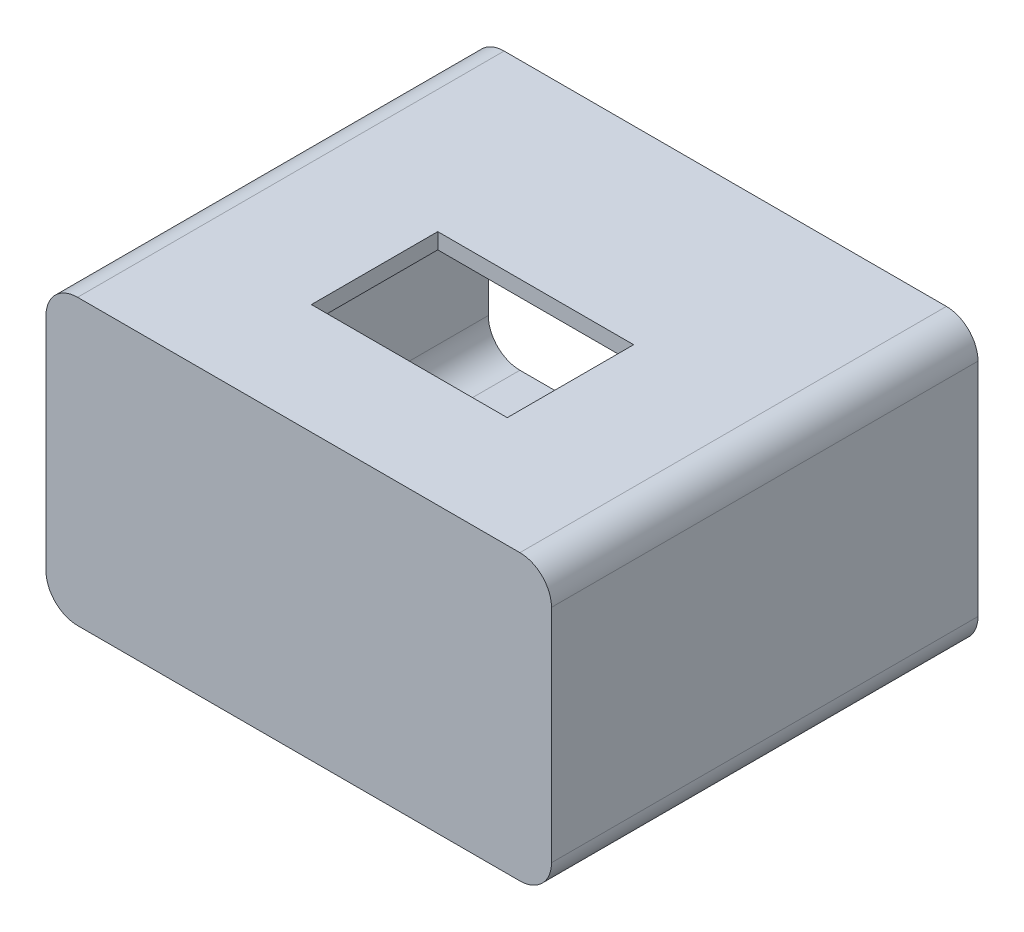
ISO-10303-21;
HEADER;
FILE_DESCRIPTION(('STEP AP214'),'2;1');
FILE_NAME('part.step','',(''),(''),'','','');
FILE_SCHEMA(('AUTOMOTIVE_DESIGN { 1 0 10303 214 1 1 1 1 }'));
ENDSEC;
DATA;
#1=APPLICATION_CONTEXT('core data for automotive mechanical design processes');
#2=APPLICATION_PROTOCOL_DEFINITION('international standard','automotive_design',2000,#1);
#3=PRODUCT_CONTEXT('',#1,'mechanical');
#4=PRODUCT('Part','Part','',(#3));
#5=PRODUCT_RELATED_PRODUCT_CATEGORY('part','',(#4));
#6=PRODUCT_DEFINITION_FORMATION('','',#4);
#7=PRODUCT_DEFINITION_CONTEXT('part definition',#1,'design');
#8=PRODUCT_DEFINITION('design','',#6,#7);
#9=PRODUCT_DEFINITION_SHAPE('','',#8);
#10=(LENGTH_UNIT() NAMED_UNIT(*) SI_UNIT(.MILLI.,.METRE.));
#11=(NAMED_UNIT(*) PLANE_ANGLE_UNIT() SI_UNIT($,.RADIAN.));
#12=(NAMED_UNIT(*) SI_UNIT($,.STERADIAN.) SOLID_ANGLE_UNIT());
#13=UNCERTAINTY_MEASURE_WITH_UNIT(LENGTH_MEASURE(1.E-05),#10,'distance_accuracy_value','');
#14=(GEOMETRIC_REPRESENTATION_CONTEXT(3) GLOBAL_UNCERTAINTY_ASSIGNED_CONTEXT((#13)) GLOBAL_UNIT_ASSIGNED_CONTEXT((#10,
#11,#12)) REPRESENTATION_CONTEXT('',''));
#15=CARTESIAN_POINT('',(0.,0.,0.));
#16=DIRECTION('',(0.,0.,1.));
#17=DIRECTION('',(1.,0.,0.));
#18=AXIS2_PLACEMENT_3D('',#15,#16,#17);
#19=CARTESIAN_POINT('',(-32.5,15.,65.));
#20=DIRECTION('',(0.,0.,-1.));
#21=DIRECTION('',(-1.,0.,0.));
#22=AXIS2_PLACEMENT_3D('',#19,#20,#21);
#23=CYLINDRICAL_SURFACE('',#22,5.);
#24=CARTESIAN_POINT('',(-32.5,15.,0.));
#25=DIRECTION('',(0.,0.,1.));
#26=DIRECTION('',(1.,0.,0.));
#27=AXIS2_PLACEMENT_3D('',#24,#25,#26);
#28=CIRCLE('',#27,5.);
#29=CARTESIAN_POINT('',(-32.5,20.,0.));
#30=VERTEX_POINT('',#29);
#31=CARTESIAN_POINT('',(-37.5,15.,0.));
#32=VERTEX_POINT('',#31);
#33=EDGE_CURVE('E283',#30,#32,#28,.T.);
#34=ORIENTED_EDGE('',*,*,#33,.F.);
#35=DIRECTION('',(0.,0.,-1.));
#36=VECTOR('',#35,1.);
#37=CARTESIAN_POINT('',(-32.5,20.,65.));
#38=LINE('',#37,#36);
#39=CARTESIAN_POINT('',(-32.5,20.,65.));
#40=VERTEX_POINT('',#39);
#41=EDGE_CURVE('E11',#40,#30,#38,.T.);
#42=ORIENTED_EDGE('',*,*,#41,.F.);
#43=CARTESIAN_POINT('',(-32.5,15.,65.));
#44=DIRECTION('',(0.,0.,1.));
#45=DIRECTION('',(1.,0.,0.));
#46=AXIS2_PLACEMENT_3D('',#43,#44,#45);
#47=CIRCLE('',#46,5.);
#48=CARTESIAN_POINT('',(-37.5,15.,65.));
#49=VERTEX_POINT('',#48);
#50=EDGE_CURVE('E236',#40,#49,#47,.T.);
#51=ORIENTED_EDGE('',*,*,#50,.T.);
#52=DIRECTION('',(0.,0.,-1.));
#53=VECTOR('',#52,1.);
#54=CARTESIAN_POINT('',(-37.5,15.,65.));
#55=LINE('',#54,#53);
#56=EDGE_CURVE('E306',#49,#32,#55,.T.);
#57=ORIENTED_EDGE('',*,*,#56,.T.);
#58=EDGE_LOOP('',(#34,#42,#51,#57));
#59=FACE_BOUND('',#58,.T.);
#60=ADVANCED_FACE('F37',(#59),#23,.F.);
#61=CARTESIAN_POINT('',(0.,20.,65.));
#62=DIRECTION('',(0.,-1.,0.));
#63=DIRECTION('',(1.,0.,0.));
#64=AXIS2_PLACEMENT_3D('',#61,#62,#63);
#65=PLANE('',#64);
#66=DIRECTION('',(0.,0.,-1.));
#67=VECTOR('',#66,1.);
#68=CARTESIAN_POINT('',(15.5,20.,30.));
#69=LINE('',#68,#67);
#70=CARTESIAN_POINT('',(15.5,20.,50.));
#71=VERTEX_POINT('',#70);
#72=CARTESIAN_POINT('',(15.5,20.,30.));
#73=VERTEX_POINT('',#72);
#74=EDGE_CURVE('E178',#71,#73,#69,.T.);
#75=ORIENTED_EDGE('',*,*,#74,.T.);
#76=DIRECTION('',(-1.,0.,0.));
#77=VECTOR('',#76,1.);
#78=CARTESIAN_POINT('',(-15.5,20.,30.));
#79=LINE('',#78,#77);
#80=CARTESIAN_POINT('',(-15.5,20.,30.));
#81=VERTEX_POINT('',#80);
#82=EDGE_CURVE('E201',#73,#81,#79,.T.);
#83=ORIENTED_EDGE('',*,*,#82,.T.);
#84=DIRECTION('',(0.,0.,1.));
#85=VECTOR('',#84,1.);
#86=CARTESIAN_POINT('',(-15.5,20.,30.));
#87=LINE('',#86,#85);
#88=CARTESIAN_POINT('',(-15.5,20.,50.));
#89=VERTEX_POINT('',#88);
#90=EDGE_CURVE('E181',#81,#89,#87,.T.);
#91=ORIENTED_EDGE('',*,*,#90,.T.);
#92=DIRECTION('',(1.,0.,0.));
#93=VECTOR('',#92,1.);
#94=CARTESIAN_POINT('',(-15.5,20.,50.));
#95=LINE('',#94,#93);
#96=EDGE_CURVE('E182',#89,#71,#95,.T.);
#97=ORIENTED_EDGE('',*,*,#96,.T.);
#98=EDGE_LOOP('',(#75,#83,#91,#97));
#99=FACE_BOUND('',#98,.T.);
#100=DIRECTION('',(-1.,0.,0.));
#101=VECTOR('',#100,1.);
#102=CARTESIAN_POINT('',(0.,20.,0.));
#103=LINE('',#102,#101);
#104=CARTESIAN_POINT('',(32.5,20.,0.));
#105=VERTEX_POINT('',#104);
#106=EDGE_CURVE('E286',#105,#30,#103,.T.);
#107=ORIENTED_EDGE('',*,*,#106,.F.);
#108=DIRECTION('',(0.,0.,-1.));
#109=VECTOR('',#108,1.);
#110=CARTESIAN_POINT('',(32.5,20.,65.));
#111=LINE('',#110,#109);
#112=CARTESIAN_POINT('',(32.5,20.,65.));
#113=VERTEX_POINT('',#112);
#114=EDGE_CURVE('E46',#113,#105,#111,.T.);
#115=ORIENTED_EDGE('',*,*,#114,.F.);
#116=DIRECTION('',(-1.,0.,0.));
#117=VECTOR('',#116,1.);
#118=CARTESIAN_POINT('',(0.,20.,65.));
#119=LINE('',#118,#117);
#120=EDGE_CURVE('E239',#113,#40,#119,.T.);
#121=ORIENTED_EDGE('',*,*,#120,.T.);
#122=ORIENTED_EDGE('',*,*,#41,.T.);
#123=EDGE_LOOP('',(#107,#115,#121,#122));
#124=FACE_BOUND('',#123,.T.);
#125=ADVANCED_FACE('F378',(#99,#124),#65,.T.);
#126=CARTESIAN_POINT('',(32.5,15.,65.));
#127=DIRECTION('',(0.,0.,-1.));
#128=DIRECTION('',(-1.,0.,0.));
#129=AXIS2_PLACEMENT_3D('',#126,#127,#128);
#130=CYLINDRICAL_SURFACE('',#129,5.);
#131=CARTESIAN_POINT('',(32.5,15.,0.));
#132=DIRECTION('',(0.,0.,1.));
#133=DIRECTION('',(1.,0.,0.));
#134=AXIS2_PLACEMENT_3D('',#131,#132,#133);
#135=CIRCLE('',#134,5.);
#136=CARTESIAN_POINT('',(37.5,15.,0.));
#137=VERTEX_POINT('',#136);
#138=EDGE_CURVE('E289',#137,#105,#135,.T.);
#139=ORIENTED_EDGE('',*,*,#138,.F.);
#140=DIRECTION('',(0.,0.,-1.));
#141=VECTOR('',#140,1.);
#142=CARTESIAN_POINT('',(37.5,15.,65.));
#143=LINE('',#142,#141);
#144=CARTESIAN_POINT('',(37.5,15.,65.));
#145=VERTEX_POINT('',#144);
#146=EDGE_CURVE('E316',#145,#137,#143,.T.);
#147=ORIENTED_EDGE('',*,*,#146,.F.);
#148=CARTESIAN_POINT('',(32.5,15.,65.));
#149=DIRECTION('',(0.,0.,1.));
#150=DIRECTION('',(1.,0.,0.));
#151=AXIS2_PLACEMENT_3D('',#148,#149,#150);
#152=CIRCLE('',#151,5.);
#153=EDGE_CURVE('E243',#145,#113,#152,.T.);
#154=ORIENTED_EDGE('',*,*,#153,.T.);
#155=ORIENTED_EDGE('',*,*,#114,.T.);
#156=EDGE_LOOP('',(#139,#147,#154,#155));
#157=FACE_BOUND('',#156,.T.);
#158=ADVANCED_FACE('F383',(#157),#130,.F.);
#159=CARTESIAN_POINT('',(37.5,0.,65.));
#160=DIRECTION('',(-1.,0.,0.));
#161=DIRECTION('',(0.,-1.,0.));
#162=AXIS2_PLACEMENT_3D('',#159,#160,#161);
#163=PLANE('',#162);
#164=DIRECTION('',(0.,1.,0.));
#165=VECTOR('',#164,1.);
#166=CARTESIAN_POINT('',(37.5,0.,0.));
#167=LINE('',#166,#165);
#168=CARTESIAN_POINT('',(37.5,-15.,0.));
#169=VERTEX_POINT('',#168);
#170=EDGE_CURVE('E292',#169,#137,#167,.T.);
#171=ORIENTED_EDGE('',*,*,#170,.F.);
#172=DIRECTION('',(0.,0.,-1.));
#173=VECTOR('',#172,1.);
#174=CARTESIAN_POINT('',(37.5,-15.,65.));
#175=LINE('',#174,#173);
#176=CARTESIAN_POINT('',(37.5,-15.,65.));
#177=VERTEX_POINT('',#176);
#178=EDGE_CURVE('E314',#177,#169,#175,.T.);
#179=ORIENTED_EDGE('',*,*,#178,.F.);
#180=DIRECTION('',(0.,1.,0.));
#181=VECTOR('',#180,1.);
#182=CARTESIAN_POINT('',(37.5,0.,65.));
#183=LINE('',#182,#181);
#184=EDGE_CURVE('E246',#177,#145,#183,.T.);
#185=ORIENTED_EDGE('',*,*,#184,.T.);
#186=ORIENTED_EDGE('',*,*,#146,.T.);
#187=EDGE_LOOP('',(#171,#179,#185,#186));
#188=FACE_BOUND('',#187,.T.);
#189=ADVANCED_FACE('F390',(#188),#163,.T.);
#190=CARTESIAN_POINT('',(32.5,-15.,65.));
#191=DIRECTION('',(0.,0.,-1.));
#192=DIRECTION('',(-1.,0.,0.));
#193=AXIS2_PLACEMENT_3D('',#190,#191,#192);
#194=CYLINDRICAL_SURFACE('',#193,5.);
#195=CARTESIAN_POINT('',(32.5,-15.,0.));
#196=DIRECTION('',(0.,0.,1.));
#197=DIRECTION('',(1.,0.,0.));
#198=AXIS2_PLACEMENT_3D('',#195,#196,#197);
#199=CIRCLE('',#198,5.);
#200=CARTESIAN_POINT('',(32.5,-20.,0.));
#201=VERTEX_POINT('',#200);
#202=EDGE_CURVE('E295',#201,#169,#199,.T.);
#203=ORIENTED_EDGE('',*,*,#202,.F.);
#204=DIRECTION('',(0.,0.,-1.));
#205=VECTOR('',#204,1.);
#206=CARTESIAN_POINT('',(32.5,-20.,65.));
#207=LINE('',#206,#205);
#208=CARTESIAN_POINT('',(32.5,-20.,65.));
#209=VERTEX_POINT('',#208);
#210=EDGE_CURVE('E312',#209,#201,#207,.T.);
#211=ORIENTED_EDGE('',*,*,#210,.F.);
#212=CARTESIAN_POINT('',(32.5,-15.,65.));
#213=DIRECTION('',(0.,0.,1.));
#214=DIRECTION('',(1.,0.,0.));
#215=AXIS2_PLACEMENT_3D('',#212,#213,#214);
#216=CIRCLE('',#215,5.);
#217=EDGE_CURVE('E249',#209,#177,#216,.T.);
#218=ORIENTED_EDGE('',*,*,#217,.T.);
#219=ORIENTED_EDGE('',*,*,#178,.T.);
#220=EDGE_LOOP('',(#203,#211,#218,#219));
#221=FACE_BOUND('',#220,.T.);
#222=ADVANCED_FACE('F394',(#221),#194,.F.);
#223=CARTESIAN_POINT('',(0.,-20.,65.));
#224=DIRECTION('',(0.,1.,0.));
#225=DIRECTION('',(-1.,0.,0.));
#226=AXIS2_PLACEMENT_3D('',#223,#224,#225);
#227=PLANE('',#226);
#228=DIRECTION('',(1.,0.,0.));
#229=VECTOR('',#228,1.);
#230=CARTESIAN_POINT('',(0.,-20.,0.));
#231=LINE('',#230,#229);
#232=CARTESIAN_POINT('',(-32.5,-20.,0.));
#233=VERTEX_POINT('',#232);
#234=EDGE_CURVE('E298',#233,#201,#231,.T.);
#235=ORIENTED_EDGE('',*,*,#234,.F.);
#236=DIRECTION('',(0.,0.,-1.));
#237=VECTOR('',#236,1.);
#238=CARTESIAN_POINT('',(-32.5,-20.,65.));
#239=LINE('',#238,#237);
#240=CARTESIAN_POINT('',(-32.5,-20.,65.));
#241=VERTEX_POINT('',#240);
#242=EDGE_CURVE('E310',#241,#233,#239,.T.);
#243=ORIENTED_EDGE('',*,*,#242,.F.);
#244=DIRECTION('',(1.,0.,0.));
#245=VECTOR('',#244,1.);
#246=CARTESIAN_POINT('',(0.,-20.,65.));
#247=LINE('',#246,#245);
#248=EDGE_CURVE('E252',#241,#209,#247,.T.);
#249=ORIENTED_EDGE('',*,*,#248,.T.);
#250=ORIENTED_EDGE('',*,*,#210,.T.);
#251=EDGE_LOOP('',(#235,#243,#249,#250));
#252=FACE_BOUND('',#251,.T.);
#253=ADVANCED_FACE('F398',(#252),#227,.T.);
#254=CARTESIAN_POINT('',(-32.5,-15.,65.));
#255=DIRECTION('',(0.,0.,-1.));
#256=DIRECTION('',(-1.,0.,0.));
#257=AXIS2_PLACEMENT_3D('',#254,#255,#256);
#258=CYLINDRICAL_SURFACE('',#257,5.);
#259=CARTESIAN_POINT('',(-32.5,-15.,0.));
#260=DIRECTION('',(0.,0.,1.));
#261=DIRECTION('',(1.,0.,0.));
#262=AXIS2_PLACEMENT_3D('',#259,#260,#261);
#263=CIRCLE('',#262,5.);
#264=CARTESIAN_POINT('',(-37.5,-15.,0.));
#265=VERTEX_POINT('',#264);
#266=EDGE_CURVE('E301',#265,#233,#263,.T.);
#267=ORIENTED_EDGE('',*,*,#266,.F.);
#268=DIRECTION('',(0.,0.,-1.));
#269=VECTOR('',#268,1.);
#270=CARTESIAN_POINT('',(-37.5,-15.,65.));
#271=LINE('',#270,#269);
#272=CARTESIAN_POINT('',(-37.5,-15.,65.));
#273=VERTEX_POINT('',#272);
#274=EDGE_CURVE('E308',#273,#265,#271,.T.);
#275=ORIENTED_EDGE('',*,*,#274,.F.);
#276=CARTESIAN_POINT('',(-32.5,-15.,65.));
#277=DIRECTION('',(0.,0.,1.));
#278=DIRECTION('',(1.,0.,0.));
#279=AXIS2_PLACEMENT_3D('',#276,#277,#278);
#280=CIRCLE('',#279,5.);
#281=EDGE_CURVE('E255',#273,#241,#280,.T.);
#282=ORIENTED_EDGE('',*,*,#281,.T.);
#283=ORIENTED_EDGE('',*,*,#242,.T.);
#284=EDGE_LOOP('',(#267,#275,#282,#283));
#285=FACE_BOUND('',#284,.T.);
#286=ADVANCED_FACE('F402',(#285),#258,.F.);
#287=CARTESIAN_POINT('',(-35.,17.5,65.));
#288=DIRECTION('',(0.,0.,-1.));
#289=DIRECTION('',(-1.,0.,0.));
#290=AXIS2_PLACEMENT_3D('',#287,#288,#289);
#291=CYLINDRICAL_SURFACE('',#290,5.);
#292=CARTESIAN_POINT('',(-35.,17.5,0.));
#293=DIRECTION('',(0.,0.,1.));
#294=DIRECTION('',(1.,0.,0.));
#295=AXIS2_PLACEMENT_3D('',#292,#293,#294);
#296=CIRCLE('',#295,5.);
#297=CARTESIAN_POINT('',(-40.,17.5,0.));
#298=VERTEX_POINT('',#297);
#299=CARTESIAN_POINT('',(-35.,22.5,0.));
#300=VERTEX_POINT('',#299);
#301=EDGE_CURVE('E235',#298,#300,#296,.F.);
#302=ORIENTED_EDGE('',*,*,#301,.F.);
#303=DIRECTION('',(0.,0.,-1.));
#304=VECTOR('',#303,1.);
#305=CARTESIAN_POINT('',(-40.,17.5,65.));
#306=LINE('',#305,#304);
#307=CARTESIAN_POINT('',(-40.,17.5,67.5));
#308=VERTEX_POINT('',#307);
#309=EDGE_CURVE('E41',#308,#298,#306,.T.);
#310=ORIENTED_EDGE('',*,*,#309,.F.);
#311=CARTESIAN_POINT('',(-35.,17.5,67.5));
#312=DIRECTION('',(0.,0.,1.));
#313=DIRECTION('',(1.,0.,0.));
#314=AXIS2_PLACEMENT_3D('',#311,#312,#313);
#315=CIRCLE('',#314,5.);
#316=CARTESIAN_POINT('',(-35.,22.5,67.5));
#317=VERTEX_POINT('',#316);
#318=EDGE_CURVE('E214',#317,#308,#315,.T.);
#319=ORIENTED_EDGE('',*,*,#318,.F.);
#320=DIRECTION('',(0.,0.,-1.));
#321=VECTOR('',#320,1.);
#322=CARTESIAN_POINT('',(-35.,22.5,65.));
#323=LINE('',#322,#321);
#324=EDGE_CURVE('E261',#317,#300,#323,.T.);
#325=ORIENTED_EDGE('',*,*,#324,.T.);
#326=EDGE_LOOP('',(#302,#310,#319,#325));
#327=FACE_BOUND('',#326,.T.);
#328=ADVANCED_FACE('F39',(#327),#291,.T.);
#329=CARTESIAN_POINT('',(-40.,0.,65.));
#330=DIRECTION('',(-1.,0.,0.));
#331=DIRECTION('',(0.,0.,1.));
#332=AXIS2_PLACEMENT_3D('',#329,#330,#331);
#333=PLANE('',#332);
#334=DIRECTION('',(0.,1.,0.));
#335=VECTOR('',#334,1.);
#336=CARTESIAN_POINT('',(-40.,0.,0.));
#337=LINE('',#336,#335);
#338=CARTESIAN_POINT('',(-40.,-17.5,0.));
#339=VERTEX_POINT('',#338);
#340=EDGE_CURVE('E264',#339,#298,#337,.T.);
#341=ORIENTED_EDGE('',*,*,#340,.F.);
#342=DIRECTION('',(0.,0.,-1.));
#343=VECTOR('',#342,1.);
#344=CARTESIAN_POINT('',(-40.,-17.5,65.));
#345=LINE('',#344,#343);
#346=CARTESIAN_POINT('',(-40.,-17.5,67.5));
#347=VERTEX_POINT('',#346);
#348=EDGE_CURVE('E331',#347,#339,#345,.T.);
#349=ORIENTED_EDGE('',*,*,#348,.F.);
#350=DIRECTION('',(0.,-1.,0.));
#351=VECTOR('',#350,1.);
#352=CARTESIAN_POINT('',(-40.,17.5,67.5));
#353=LINE('',#352,#351);
#354=EDGE_CURVE('E217',#308,#347,#353,.T.);
#355=ORIENTED_EDGE('',*,*,#354,.F.);
#356=ORIENTED_EDGE('',*,*,#309,.T.);
#357=EDGE_LOOP('',(#341,#349,#355,#356));
#358=FACE_BOUND('',#357,.T.);
#359=ADVANCED_FACE('F339',(#358),#333,.T.);
#360=CARTESIAN_POINT('',(-35.,-17.5,65.));
#361=DIRECTION('',(0.,0.,-1.));
#362=DIRECTION('',(-1.,0.,0.));
#363=AXIS2_PLACEMENT_3D('',#360,#361,#362);
#364=CYLINDRICAL_SURFACE('',#363,5.);
#365=CARTESIAN_POINT('',(-35.,-17.5,0.));
#366=DIRECTION('',(0.,0.,1.));
#367=DIRECTION('',(1.,0.,0.));
#368=AXIS2_PLACEMENT_3D('',#365,#366,#367);
#369=CIRCLE('',#368,5.);
#370=CARTESIAN_POINT('',(-35.,-22.5,0.));
#371=VERTEX_POINT('',#370);
#372=EDGE_CURVE('E267',#371,#339,#369,.F.);
#373=ORIENTED_EDGE('',*,*,#372,.F.);
#374=DIRECTION('',(0.,0.,-1.));
#375=VECTOR('',#374,1.);
#376=CARTESIAN_POINT('',(-35.,-22.5,65.));
#377=LINE('',#376,#375);
#378=CARTESIAN_POINT('',(-35.,-22.5,67.5));
#379=VERTEX_POINT('',#378);
#380=EDGE_CURVE('E330',#379,#371,#377,.T.);
#381=ORIENTED_EDGE('',*,*,#380,.F.);
#382=CARTESIAN_POINT('',(-35.,-17.5,67.5));
#383=DIRECTION('',(0.,0.,1.));
#384=DIRECTION('',(1.,0.,0.));
#385=AXIS2_PLACEMENT_3D('',#382,#383,#384);
#386=CIRCLE('',#385,5.);
#387=EDGE_CURVE('E220',#347,#379,#386,.T.);
#388=ORIENTED_EDGE('',*,*,#387,.F.);
#389=ORIENTED_EDGE('',*,*,#348,.T.);
#390=EDGE_LOOP('',(#373,#381,#388,#389));
#391=FACE_BOUND('',#390,.T.);
#392=ADVANCED_FACE('F348',(#391),#364,.T.);
#393=CARTESIAN_POINT('',(0.,-22.5,65.));
#394=DIRECTION('',(0.,1.,0.));
#395=DIRECTION('',(0.,0.,1.));
#396=AXIS2_PLACEMENT_3D('',#393,#394,#395);
#397=PLANE('',#396);
#398=DIRECTION('',(1.,0.,0.));
#399=VECTOR('',#398,1.);
#400=CARTESIAN_POINT('',(0.,-22.5,0.));
#401=LINE('',#400,#399);
#402=CARTESIAN_POINT('',(35.,-22.5,0.));
#403=VERTEX_POINT('',#402);
#404=EDGE_CURVE('E270',#371,#403,#401,.T.);
#405=ORIENTED_EDGE('',*,*,#404,.T.);
#406=DIRECTION('',(0.,0.,-1.));
#407=VECTOR('',#406,1.);
#408=CARTESIAN_POINT('',(35.,-22.5,65.));
#409=LINE('',#408,#407);
#410=CARTESIAN_POINT('',(35.,-22.5,67.5));
#411=VERTEX_POINT('',#410);
#412=EDGE_CURVE('E327',#411,#403,#409,.T.);
#413=ORIENTED_EDGE('',*,*,#412,.F.);
#414=DIRECTION('',(1.,0.,0.));
#415=VECTOR('',#414,1.);
#416=CARTESIAN_POINT('',(-35.,-22.5,67.5));
#417=LINE('',#416,#415);
#418=EDGE_CURVE('E223',#379,#411,#417,.T.);
#419=ORIENTED_EDGE('',*,*,#418,.F.);
#420=ORIENTED_EDGE('',*,*,#380,.T.);
#421=EDGE_LOOP('',(#405,#413,#419,#420));
#422=FACE_BOUND('',#421,.T.);
#423=ADVANCED_FACE('F354',(#422),#397,.F.);
#424=CARTESIAN_POINT('',(35.,-17.5,65.));
#425=DIRECTION('',(0.,0.,-1.));
#426=DIRECTION('',(-1.,0.,0.));
#427=AXIS2_PLACEMENT_3D('',#424,#425,#426);
#428=CYLINDRICAL_SURFACE('',#427,5.);
#429=CARTESIAN_POINT('',(35.,-17.5,0.));
#430=DIRECTION('',(0.,0.,1.));
#431=DIRECTION('',(1.,0.,0.));
#432=AXIS2_PLACEMENT_3D('',#429,#430,#431);
#433=CIRCLE('',#432,5.);
#434=CARTESIAN_POINT('',(40.,-17.5,0.));
#435=VERTEX_POINT('',#434);
#436=EDGE_CURVE('E272',#403,#435,#433,.T.);
#437=ORIENTED_EDGE('',*,*,#436,.T.);
#438=DIRECTION('',(0.,0.,-1.));
#439=VECTOR('',#438,1.);
#440=CARTESIAN_POINT('',(40.,-17.5,65.));
#441=LINE('',#440,#439);
#442=CARTESIAN_POINT('',(40.,-17.5,67.5));
#443=VERTEX_POINT('',#442);
#444=EDGE_CURVE('E324',#443,#435,#441,.T.);
#445=ORIENTED_EDGE('',*,*,#444,.F.);
#446=CARTESIAN_POINT('',(35.,-17.5,67.5));
#447=DIRECTION('',(0.,0.,1.));
#448=DIRECTION('',(1.,0.,0.));
#449=AXIS2_PLACEMENT_3D('',#446,#447,#448);
#450=CIRCLE('',#449,5.);
#451=EDGE_CURVE('E226',#411,#443,#450,.T.);
#452=ORIENTED_EDGE('',*,*,#451,.F.);
#453=ORIENTED_EDGE('',*,*,#412,.T.);
#454=EDGE_LOOP('',(#437,#445,#452,#453));
#455=FACE_BOUND('',#454,.T.);
#456=ADVANCED_FACE('F356',(#455),#428,.T.);
#457=CARTESIAN_POINT('',(40.,0.,65.));
#458=DIRECTION('',(-1.,0.,0.));
#459=DIRECTION('',(0.,0.,1.));
#460=AXIS2_PLACEMENT_3D('',#457,#458,#459);
#461=PLANE('',#460);
#462=DIRECTION('',(0.,1.,0.));
#463=VECTOR('',#462,1.);
#464=CARTESIAN_POINT('',(40.,0.,0.));
#465=LINE('',#464,#463);
#466=CARTESIAN_POINT('',(40.,17.5,0.));
#467=VERTEX_POINT('',#466);
#468=EDGE_CURVE('E274',#435,#467,#465,.T.);
#469=ORIENTED_EDGE('',*,*,#468,.T.);
#470=DIRECTION('',(0.,0.,-1.));
#471=VECTOR('',#470,1.);
#472=CARTESIAN_POINT('',(40.,17.5,65.));
#473=LINE('',#472,#471);
#474=CARTESIAN_POINT('',(40.,17.5,67.5));
#475=VERTEX_POINT('',#474);
#476=EDGE_CURVE('E322',#475,#467,#473,.T.);
#477=ORIENTED_EDGE('',*,*,#476,.F.);
#478=DIRECTION('',(0.,1.,0.));
#479=VECTOR('',#478,1.);
#480=CARTESIAN_POINT('',(40.,-17.5,67.5));
#481=LINE('',#480,#479);
#482=EDGE_CURVE('E229',#443,#475,#481,.T.);
#483=ORIENTED_EDGE('',*,*,#482,.F.);
#484=ORIENTED_EDGE('',*,*,#444,.T.);
#485=EDGE_LOOP('',(#469,#477,#483,#484));
#486=FACE_BOUND('',#485,.T.);
#487=ADVANCED_FACE('F360',(#486),#461,.F.);
#488=CARTESIAN_POINT('',(35.,17.5,65.));
#489=DIRECTION('',(0.,0.,-1.));
#490=DIRECTION('',(-1.,0.,0.));
#491=AXIS2_PLACEMENT_3D('',#488,#489,#490);
#492=CYLINDRICAL_SURFACE('',#491,5.);
#493=CARTESIAN_POINT('',(35.,17.5,0.));
#494=DIRECTION('',(0.,0.,1.));
#495=DIRECTION('',(1.,0.,0.));
#496=AXIS2_PLACEMENT_3D('',#493,#494,#495);
#497=CIRCLE('',#496,5.);
#498=CARTESIAN_POINT('',(35.,22.5,0.));
#499=VERTEX_POINT('',#498);
#500=EDGE_CURVE('E277',#499,#467,#497,.F.);
#501=ORIENTED_EDGE('',*,*,#500,.F.);
#502=DIRECTION('',(0.,0.,-1.));
#503=VECTOR('',#502,1.);
#504=CARTESIAN_POINT('',(35.,22.5,65.));
#505=LINE('',#504,#503);
#506=CARTESIAN_POINT('',(35.,22.5,67.5));
#507=VERTEX_POINT('',#506);
#508=EDGE_CURVE('E320',#507,#499,#505,.T.);
#509=ORIENTED_EDGE('',*,*,#508,.F.);
#510=CARTESIAN_POINT('',(35.,17.5,67.5));
#511=DIRECTION('',(0.,0.,1.));
#512=DIRECTION('',(1.,0.,0.));
#513=AXIS2_PLACEMENT_3D('',#510,#511,#512);
#514=CIRCLE('',#513,5.);
#515=EDGE_CURVE('E232',#475,#507,#514,.T.);
#516=ORIENTED_EDGE('',*,*,#515,.F.);
#517=ORIENTED_EDGE('',*,*,#476,.T.);
#518=EDGE_LOOP('',(#501,#509,#516,#517));
#519=FACE_BOUND('',#518,.T.);
#520=ADVANCED_FACE('F365',(#519),#492,.T.);
#521=CARTESIAN_POINT('',(0.,22.5,65.));
#522=DIRECTION('',(0.,1.,0.));
#523=DIRECTION('',(0.,0.,1.));
#524=AXIS2_PLACEMENT_3D('',#521,#522,#523);
#525=PLANE('',#524);
#526=DIRECTION('',(0.,0.,-1.));
#527=VECTOR('',#526,1.);
#528=CARTESIAN_POINT('',(15.5,22.5,30.));
#529=LINE('',#528,#527);
#530=CARTESIAN_POINT('',(15.5,22.5,50.));
#531=VERTEX_POINT('',#530);
#532=CARTESIAN_POINT('',(15.5,22.5,30.));
#533=VERTEX_POINT('',#532);
#534=EDGE_CURVE('E62',#531,#533,#529,.T.);
#535=ORIENTED_EDGE('',*,*,#534,.F.);
#536=DIRECTION('',(1.,0.,0.));
#537=VECTOR('',#536,1.);
#538=CARTESIAN_POINT('',(-15.5,22.5,50.));
#539=LINE('',#538,#537);
#540=CARTESIAN_POINT('',(-15.5,22.5,50.));
#541=VERTEX_POINT('',#540);
#542=EDGE_CURVE('E185',#541,#531,#539,.T.);
#543=ORIENTED_EDGE('',*,*,#542,.F.);
#544=DIRECTION('',(0.,0.,1.));
#545=VECTOR('',#544,1.);
#546=CARTESIAN_POINT('',(-15.5,22.5,30.));
#547=LINE('',#546,#545);
#548=CARTESIAN_POINT('',(-15.5,22.5,30.));
#549=VERTEX_POINT('',#548);
#550=EDGE_CURVE('E193',#549,#541,#547,.T.);
#551=ORIENTED_EDGE('',*,*,#550,.F.);
#552=DIRECTION('',(-1.,0.,0.));
#553=VECTOR('',#552,1.);
#554=CARTESIAN_POINT('',(-15.5,22.5,30.));
#555=LINE('',#554,#553);
#556=EDGE_CURVE('E198',#533,#549,#555,.T.);
#557=ORIENTED_EDGE('',*,*,#556,.F.);
#558=EDGE_LOOP('',(#535,#543,#551,#557));
#559=FACE_BOUND('',#558,.T.);
#560=DIRECTION('',(1.,0.,0.));
#561=VECTOR('',#560,1.);
#562=CARTESIAN_POINT('',(0.,22.5,0.));
#563=LINE('',#562,#561);
#564=EDGE_CURVE('E280',#300,#499,#563,.T.);
#565=ORIENTED_EDGE('',*,*,#564,.F.);
#566=ORIENTED_EDGE('',*,*,#324,.F.);
#567=DIRECTION('',(-1.,0.,0.));
#568=VECTOR('',#567,1.);
#569=CARTESIAN_POINT('',(35.,22.5,67.5));
#570=LINE('',#569,#568);
#571=EDGE_CURVE('E192',#507,#317,#570,.T.);
#572=ORIENTED_EDGE('',*,*,#571,.F.);
#573=ORIENTED_EDGE('',*,*,#508,.T.);
#574=EDGE_LOOP('',(#565,#566,#572,#573));
#575=FACE_BOUND('',#574,.T.);
#576=ADVANCED_FACE('F196',(#559,#575),#525,.T.);
#577=CARTESIAN_POINT('',(-37.5,0.,65.));
#578=DIRECTION('',(1.,0.,0.));
#579=DIRECTION('',(0.,1.,0.));
#580=AXIS2_PLACEMENT_3D('',#577,#578,#579);
#581=PLANE('',#580);
#582=DIRECTION('',(0.,-1.,0.));
#583=VECTOR('',#582,1.);
#584=CARTESIAN_POINT('',(-37.5,0.,0.));
#585=LINE('',#584,#583);
#586=EDGE_CURVE('E240',#32,#265,#585,.T.);
#587=ORIENTED_EDGE('',*,*,#586,.F.);
#588=ORIENTED_EDGE('',*,*,#56,.F.);
#589=DIRECTION('',(0.,-1.,0.));
#590=VECTOR('',#589,1.);
#591=CARTESIAN_POINT('',(-37.5,0.,65.));
#592=LINE('',#591,#590);
#593=EDGE_CURVE('E258',#49,#273,#592,.T.);
#594=ORIENTED_EDGE('',*,*,#593,.T.);
#595=ORIENTED_EDGE('',*,*,#274,.T.);
#596=EDGE_LOOP('',(#587,#588,#594,#595));
#597=FACE_BOUND('',#596,.T.);
#598=ADVANCED_FACE('F367',(#597),#581,.T.);
#599=CARTESIAN_POINT('',(0.,0.,0.));
#600=DIRECTION('',(0.,0.,1.));
#601=DIRECTION('',(1.,0.,0.));
#602=AXIS2_PLACEMENT_3D('',#599,#600,#601);
#603=PLANE('',#602);
#604=ORIENTED_EDGE('',*,*,#301,.T.);
#605=ORIENTED_EDGE('',*,*,#564,.T.);
#606=ORIENTED_EDGE('',*,*,#500,.T.);
#607=ORIENTED_EDGE('',*,*,#468,.F.);
#608=ORIENTED_EDGE('',*,*,#436,.F.);
#609=ORIENTED_EDGE('',*,*,#404,.F.);
#610=ORIENTED_EDGE('',*,*,#372,.T.);
#611=ORIENTED_EDGE('',*,*,#340,.T.);
#612=EDGE_LOOP('',(#604,#605,#606,#607,#608,#609,#610,#611));
#613=FACE_BOUND('',#612,.T.);
#614=ORIENTED_EDGE('',*,*,#33,.T.);
#615=ORIENTED_EDGE('',*,*,#586,.T.);
#616=ORIENTED_EDGE('',*,*,#266,.T.);
#617=ORIENTED_EDGE('',*,*,#234,.T.);
#618=ORIENTED_EDGE('',*,*,#202,.T.);
#619=ORIENTED_EDGE('',*,*,#170,.T.);
#620=ORIENTED_EDGE('',*,*,#138,.T.);
#621=ORIENTED_EDGE('',*,*,#106,.T.);
#622=EDGE_LOOP('',(#614,#615,#616,#617,#618,#619,#620,#621));
#623=FACE_BOUND('',#622,.T.);
#624=ADVANCED_FACE('F344',(#613,#623),#603,.F.);
#625=CARTESIAN_POINT('',(-35.,17.5,65.));
#626=DIRECTION('',(0.,0.,1.));
#627=DIRECTION('',(1.,0.,0.));
#628=AXIS2_PLACEMENT_3D('',#625,#626,#627);
#629=PLANE('',#628);
#630=ORIENTED_EDGE('',*,*,#50,.F.);
#631=ORIENTED_EDGE('',*,*,#120,.F.);
#632=ORIENTED_EDGE('',*,*,#153,.F.);
#633=ORIENTED_EDGE('',*,*,#184,.F.);
#634=ORIENTED_EDGE('',*,*,#217,.F.);
#635=ORIENTED_EDGE('',*,*,#248,.F.);
#636=ORIENTED_EDGE('',*,*,#281,.F.);
#637=ORIENTED_EDGE('',*,*,#593,.F.);
#638=EDGE_LOOP('',(#630,#631,#632,#633,#634,#635,#636,#637));
#639=FACE_BOUND('',#638,.T.);
#640=ADVANCED_FACE('F409',(#639),#629,.F.);
#641=CARTESIAN_POINT('',(-35.,17.5,67.5));
#642=DIRECTION('',(0.,0.,1.));
#643=DIRECTION('',(1.,0.,0.));
#644=AXIS2_PLACEMENT_3D('',#641,#642,#643);
#645=PLANE('',#644);
#646=ORIENTED_EDGE('',*,*,#571,.T.);
#647=ORIENTED_EDGE('',*,*,#318,.T.);
#648=ORIENTED_EDGE('',*,*,#354,.T.);
#649=ORIENTED_EDGE('',*,*,#387,.T.);
#650=ORIENTED_EDGE('',*,*,#418,.T.);
#651=ORIENTED_EDGE('',*,*,#451,.T.);
#652=ORIENTED_EDGE('',*,*,#482,.T.);
#653=ORIENTED_EDGE('',*,*,#515,.T.);
#654=EDGE_LOOP('',(#646,#647,#648,#649,#650,#651,#652,#653));
#655=FACE_BOUND('',#654,.T.);
#656=ADVANCED_FACE('F352',(#655),#645,.T.);
#657=CARTESIAN_POINT('',(15.5,-22.501,30.));
#658=DIRECTION('',(1.,0.,0.));
#659=DIRECTION('',(0.,0.,-1.));
#660=AXIS2_PLACEMENT_3D('',#657,#658,#659);
#661=PLANE('',#660);
#662=DIRECTION('',(0.,1.,0.));
#663=VECTOR('',#662,1.);
#664=CARTESIAN_POINT('',(15.5,-22.501,50.));
#665=LINE('',#664,#663);
#666=EDGE_CURVE('E174',#71,#531,#665,.T.);
#667=ORIENTED_EDGE('',*,*,#666,.T.);
#668=ORIENTED_EDGE('',*,*,#534,.T.);
#669=DIRECTION('',(0.,1.,0.));
#670=VECTOR('',#669,1.);
#671=CARTESIAN_POINT('',(15.5,-22.501,30.));
#672=LINE('',#671,#670);
#673=EDGE_CURVE('E206',#73,#533,#672,.T.);
#674=ORIENTED_EDGE('',*,*,#673,.F.);
#675=ORIENTED_EDGE('',*,*,#74,.F.);
#676=EDGE_LOOP('',(#667,#668,#674,#675));
#677=FACE_BOUND('',#676,.T.);
#678=ADVANCED_FACE('F176',(#677),#661,.F.);
#679=CARTESIAN_POINT('',(-15.5,-22.501,50.));
#680=DIRECTION('',(0.,0.,1.));
#681=DIRECTION('',(1.,0.,0.));
#682=AXIS2_PLACEMENT_3D('',#679,#680,#681);
#683=PLANE('',#682);
#684=DIRECTION('',(0.,1.,0.));
#685=VECTOR('',#684,1.);
#686=CARTESIAN_POINT('',(-15.5,-22.501,50.));
#687=LINE('',#686,#685);
#688=EDGE_CURVE('E188',#89,#541,#687,.T.);
#689=ORIENTED_EDGE('',*,*,#688,.T.);
#690=ORIENTED_EDGE('',*,*,#542,.T.);
#691=ORIENTED_EDGE('',*,*,#666,.F.);
#692=ORIENTED_EDGE('',*,*,#96,.F.);
#693=EDGE_LOOP('',(#689,#690,#691,#692));
#694=FACE_BOUND('',#693,.T.);
#695=ADVANCED_FACE('F186',(#694),#683,.F.);
#696=CARTESIAN_POINT('',(-15.5,-22.501,30.));
#697=DIRECTION('',(-1.,0.,0.));
#698=DIRECTION('',(0.,0.,1.));
#699=AXIS2_PLACEMENT_3D('',#696,#697,#698);
#700=PLANE('',#699);
#701=DIRECTION('',(0.,1.,0.));
#702=VECTOR('',#701,1.);
#703=CARTESIAN_POINT('',(-15.5,-22.501,30.));
#704=LINE('',#703,#702);
#705=EDGE_CURVE('E54',#81,#549,#704,.T.);
#706=ORIENTED_EDGE('',*,*,#705,.T.);
#707=ORIENTED_EDGE('',*,*,#550,.T.);
#708=ORIENTED_EDGE('',*,*,#688,.F.);
#709=ORIENTED_EDGE('',*,*,#90,.F.);
#710=EDGE_LOOP('',(#706,#707,#708,#709));
#711=FACE_BOUND('',#710,.T.);
#712=ADVANCED_FACE('F419',(#711),#700,.F.);
#713=CARTESIAN_POINT('',(-15.5,-22.501,30.));
#714=DIRECTION('',(0.,0.,-1.));
#715=DIRECTION('',(-1.,0.,0.));
#716=AXIS2_PLACEMENT_3D('',#713,#714,#715);
#717=PLANE('',#716);
#718=ORIENTED_EDGE('',*,*,#673,.T.);
#719=ORIENTED_EDGE('',*,*,#556,.T.);
#720=ORIENTED_EDGE('',*,*,#705,.F.);
#721=ORIENTED_EDGE('',*,*,#82,.F.);
#722=EDGE_LOOP('',(#718,#719,#720,#721));
#723=FACE_BOUND('',#722,.T.);
#724=ADVANCED_FACE('F422',(#723),#717,.F.);
#725=CLOSED_SHELL('',(#60,#125,#158,#189,#222,#253,#286,#328,#359,#392,#423,#456,#487,#520,#576,
#598,#624,#640,#656,#678,#695,#712,#724));
#726=MANIFOLD_SOLID_BREP('B2',#725);
#727=ADVANCED_BREP_SHAPE_REPRESENTATION('',(#18,#726),#14);
#728=SHAPE_DEFINITION_REPRESENTATION(#9,#727);
ENDSEC;
END-ISO-10303-21;
